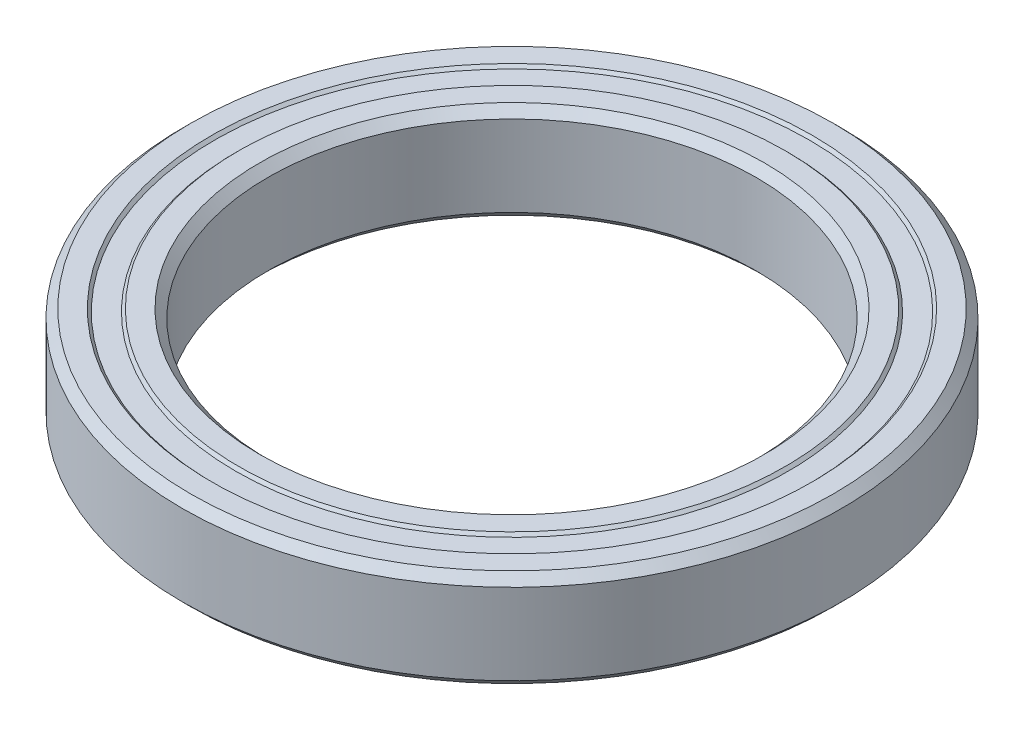
ISO-10303-21;
HEADER;
FILE_DESCRIPTION(('STEP AP214'),'2;1');
FILE_NAME('part.step','',(''),(''),'','','');
FILE_SCHEMA(('AUTOMOTIVE_DESIGN { 1 0 10303 214 1 1 1 1 }'));
ENDSEC;
DATA;
#1=APPLICATION_CONTEXT('core data for automotive mechanical design processes');
#2=APPLICATION_PROTOCOL_DEFINITION('international standard','automotive_design',2000,#1);
#3=PRODUCT_CONTEXT('',#1,'mechanical');
#4=PRODUCT('Part','Part','',(#3));
#5=PRODUCT_RELATED_PRODUCT_CATEGORY('part','',(#4));
#6=PRODUCT_DEFINITION_FORMATION('','',#4);
#7=PRODUCT_DEFINITION_CONTEXT('part definition',#1,'design');
#8=PRODUCT_DEFINITION('design','',#6,#7);
#9=PRODUCT_DEFINITION_SHAPE('','',#8);
#10=(LENGTH_UNIT() NAMED_UNIT(*) SI_UNIT(.MILLI.,.METRE.));
#11=(NAMED_UNIT(*) PLANE_ANGLE_UNIT() SI_UNIT($,.RADIAN.));
#12=(NAMED_UNIT(*) SI_UNIT($,.STERADIAN.) SOLID_ANGLE_UNIT());
#13=UNCERTAINTY_MEASURE_WITH_UNIT(LENGTH_MEASURE(1.E-05),#10,'distance_accuracy_value','');
#14=(GEOMETRIC_REPRESENTATION_CONTEXT(3) GLOBAL_UNCERTAINTY_ASSIGNED_CONTEXT((#13)) GLOBAL_UNIT_ASSIGNED_CONTEXT((#10,
#11,#12)) REPRESENTATION_CONTEXT('',''));
#15=CARTESIAN_POINT('',(0.,0.,0.));
#16=DIRECTION('',(0.,0.,1.));
#17=DIRECTION('',(1.,0.,0.));
#18=AXIS2_PLACEMENT_3D('',#15,#16,#17);
#19=CARTESIAN_POINT('',(0.,2.,0.));
#20=DIRECTION('',(0.,1.,0.));
#21=DIRECTION('',(0.,0.,1.));
#22=AXIS2_PLACEMENT_3D('',#19,#20,#21);
#23=CONICAL_SURFACE('',#22,10.34284,0.78539816339745);
#24=CARTESIAN_POINT('',(0.,1.65716,0.));
#25=DIRECTION('',(0.,-1.,0.));
#26=DIRECTION('',(0.,0.,-1.));
#27=AXIS2_PLACEMENT_3D('',#24,#25,#26);
#28=CIRCLE('',#27,10.);
#29=CARTESIAN_POINT('',(0.,1.65716,-10.));
#30=VERTEX_POINT('',#29);
#31=EDGE_CURVE('E10',#30,#30,#28,.T.);
#32=ORIENTED_EDGE('',*,*,#31,.T.);
#33=EDGE_LOOP('',(#32));
#34=FACE_BOUND('',#33,.T.);
#35=CARTESIAN_POINT('',(0.,2.,0.));
#36=DIRECTION('',(0.,-1.,0.));
#37=DIRECTION('',(0.,0.,-1.));
#38=AXIS2_PLACEMENT_3D('',#35,#36,#37);
#39=CIRCLE('',#38,10.34284);
#40=CARTESIAN_POINT('',(0.,2.,-10.34284));
#41=VERTEX_POINT('',#40);
#42=EDGE_CURVE('E89',#41,#41,#39,.T.);
#43=ORIENTED_EDGE('',*,*,#42,.F.);
#44=EDGE_LOOP('',(#43));
#45=FACE_BOUND('',#44,.T.);
#46=ADVANCED_FACE('F37',(#34,#45),#23,.F.);
#47=CARTESIAN_POINT('',(0.,-1.34942197217015,0.));
#48=DIRECTION('',(0.,-1.,0.));
#49=DIRECTION('',(0.,0.,-1.));
#50=AXIS2_PLACEMENT_3D('',#47,#48,#49);
#51=CYLINDRICAL_SURFACE('',#50,10.);
#52=CARTESIAN_POINT('',(0.,-1.65716,0.));
#53=DIRECTION('',(0.,-1.,0.));
#54=DIRECTION('',(0.,0.,-1.));
#55=AXIS2_PLACEMENT_3D('',#52,#53,#54);
#56=CIRCLE('',#55,10.);
#57=CARTESIAN_POINT('',(0.,-1.65716,-10.));
#58=VERTEX_POINT('',#57);
#59=EDGE_CURVE('E43',#58,#58,#56,.T.);
#60=ORIENTED_EDGE('',*,*,#59,.T.);
#61=EDGE_LOOP('',(#60));
#62=FACE_BOUND('',#61,.T.);
#63=ORIENTED_EDGE('',*,*,#31,.F.);
#64=EDGE_LOOP('',(#63));
#65=FACE_BOUND('',#64,.T.);
#66=ADVANCED_FACE('F97',(#62,#65),#51,.F.);
#67=CARTESIAN_POINT('',(0.,-1.65716,0.));
#68=DIRECTION('',(0.,-1.,0.));
#69=DIRECTION('',(0.,0.,-1.));
#70=AXIS2_PLACEMENT_3D('',#67,#68,#69);
#71=CONICAL_SURFACE('',#70,10.,0.785398163397446);
#72=CARTESIAN_POINT('',(0.,-2.,0.));
#73=DIRECTION('',(0.,-1.,0.));
#74=DIRECTION('',(0.,0.,-1.));
#75=AXIS2_PLACEMENT_3D('',#72,#73,#74);
#76=CIRCLE('',#75,10.34284);
#77=CARTESIAN_POINT('',(0.,-2.,-10.34284));
#78=VERTEX_POINT('',#77);
#79=EDGE_CURVE('E47',#78,#78,#76,.T.);
#80=ORIENTED_EDGE('',*,*,#79,.T.);
#81=EDGE_LOOP('',(#80));
#82=FACE_BOUND('',#81,.T.);
#83=ORIENTED_EDGE('',*,*,#59,.F.);
#84=EDGE_LOOP('',(#83));
#85=FACE_BOUND('',#84,.T.);
#86=ADVANCED_FACE('F101',(#82,#85),#71,.F.);
#87=CARTESIAN_POINT('',(10.34284,-2.,0.));
#88=DIRECTION('',(0.,-1.,0.));
#89=DIRECTION('',(0.,0.,-1.));
#90=AXIS2_PLACEMENT_3D('',#87,#88,#89);
#91=PLANE('',#90);
#92=CARTESIAN_POINT('',(0.,-2.,0.));
#93=DIRECTION('',(0.,-1.,0.));
#94=DIRECTION('',(0.,0.,-1.));
#95=AXIS2_PLACEMENT_3D('',#92,#93,#94);
#96=CIRCLE('',#95,11.19994);
#97=CARTESIAN_POINT('',(0.,-2.,-11.19994));
#98=VERTEX_POINT('',#97);
#99=EDGE_CURVE('E51',#98,#98,#96,.T.);
#100=ORIENTED_EDGE('',*,*,#99,.T.);
#101=EDGE_LOOP('',(#100));
#102=FACE_BOUND('',#101,.T.);
#103=ORIENTED_EDGE('',*,*,#79,.F.);
#104=EDGE_LOOP('',(#103));
#105=FACE_BOUND('',#104,.T.);
#106=ADVANCED_FACE('F105',(#102,#105),#91,.T.);
#107=CARTESIAN_POINT('',(0.,-2.,0.));
#108=DIRECTION('',(0.,1.,0.));
#109=DIRECTION('',(0.,0.,1.));
#110=AXIS2_PLACEMENT_3D('',#107,#108,#109);
#111=CONICAL_SURFACE('',#110,11.19994,0.785398163397439);
#112=CARTESIAN_POINT('',(0.,-1.88572,0.));
#113=DIRECTION('',(0.,-1.,0.));
#114=DIRECTION('',(0.,0.,-1.));
#115=AXIS2_PLACEMENT_3D('',#112,#113,#114);
#116=CIRCLE('',#115,11.31422);
#117=CARTESIAN_POINT('',(0.,-1.88572,-11.31422));
#118=VERTEX_POINT('',#117);
#119=EDGE_CURVE('E56',#118,#118,#116,.T.);
#120=ORIENTED_EDGE('',*,*,#119,.T.);
#121=EDGE_LOOP('',(#120));
#122=FACE_BOUND('',#121,.T.);
#123=ORIENTED_EDGE('',*,*,#99,.F.);
#124=EDGE_LOOP('',(#123));
#125=FACE_BOUND('',#124,.T.);
#126=ADVANCED_FACE('F112',(#122,#125),#111,.T.);
#127=CARTESIAN_POINT('',(11.31422,-1.88572,0.));
#128=DIRECTION('',(0.,-1.,0.));
#129=DIRECTION('',(0.,0.,-1.));
#130=AXIS2_PLACEMENT_3D('',#127,#128,#129);
#131=PLANE('',#130);
#132=CARTESIAN_POINT('',(0.,-1.88572,0.));
#133=DIRECTION('',(0.,-1.,0.));
#134=DIRECTION('',(0.,0.,-1.));
#135=AXIS2_PLACEMENT_3D('',#132,#133,#134);
#136=CIRCLE('',#135,12.18578);
#137=CARTESIAN_POINT('',(0.,-1.88572,-12.18578));
#138=VERTEX_POINT('',#137);
#139=EDGE_CURVE('E59',#138,#138,#136,.T.);
#140=ORIENTED_EDGE('',*,*,#139,.T.);
#141=EDGE_LOOP('',(#140));
#142=FACE_BOUND('',#141,.T.);
#143=ORIENTED_EDGE('',*,*,#119,.F.);
#144=EDGE_LOOP('',(#143));
#145=FACE_BOUND('',#144,.T.);
#146=ADVANCED_FACE('F116',(#142,#145),#131,.T.);
#147=CARTESIAN_POINT('',(0.,-1.88572,0.));
#148=DIRECTION('',(0.,-1.,0.));
#149=DIRECTION('',(0.,0.,-1.));
#150=AXIS2_PLACEMENT_3D('',#147,#148,#149);
#151=CONICAL_SURFACE('',#150,12.18578,0.78539816339744);
#152=CARTESIAN_POINT('',(0.,-2.,0.));
#153=DIRECTION('',(0.,-1.,0.));
#154=DIRECTION('',(0.,0.,-1.));
#155=AXIS2_PLACEMENT_3D('',#152,#153,#154);
#156=CIRCLE('',#155,12.30006);
#157=CARTESIAN_POINT('',(0.,-2.,-12.30006));
#158=VERTEX_POINT('',#157);
#159=EDGE_CURVE('E62',#158,#158,#156,.T.);
#160=ORIENTED_EDGE('',*,*,#159,.T.);
#161=EDGE_LOOP('',(#160));
#162=FACE_BOUND('',#161,.T.);
#163=ORIENTED_EDGE('',*,*,#139,.F.);
#164=EDGE_LOOP('',(#163));
#165=FACE_BOUND('',#164,.T.);
#166=ADVANCED_FACE('F120',(#162,#165),#151,.F.);
#167=CARTESIAN_POINT('',(12.30006,-2.,0.));
#168=DIRECTION('',(0.,-1.,0.));
#169=DIRECTION('',(0.,0.,-1.));
#170=AXIS2_PLACEMENT_3D('',#167,#168,#169);
#171=PLANE('',#170);
#172=CARTESIAN_POINT('',(0.,-2.,0.));
#173=DIRECTION('',(0.,-1.,0.));
#174=DIRECTION('',(0.,0.,-1.));
#175=AXIS2_PLACEMENT_3D('',#172,#173,#174);
#176=CIRCLE('',#175,13.15716);
#177=CARTESIAN_POINT('',(0.,-2.,-13.15716));
#178=VERTEX_POINT('',#177);
#179=EDGE_CURVE('E65',#178,#178,#176,.T.);
#180=ORIENTED_EDGE('',*,*,#179,.T.);
#181=EDGE_LOOP('',(#180));
#182=FACE_BOUND('',#181,.T.);
#183=ORIENTED_EDGE('',*,*,#159,.F.);
#184=EDGE_LOOP('',(#183));
#185=FACE_BOUND('',#184,.T.);
#186=ADVANCED_FACE('F124',(#182,#185),#171,.T.);
#187=CARTESIAN_POINT('',(0.,-2.,0.));
#188=DIRECTION('',(0.,1.,0.));
#189=DIRECTION('',(0.,0.,1.));
#190=AXIS2_PLACEMENT_3D('',#187,#188,#189);
#191=CONICAL_SURFACE('',#190,13.15716,0.785398163397445);
#192=CARTESIAN_POINT('',(0.,-1.65716,0.));
#193=DIRECTION('',(0.,-1.,0.));
#194=DIRECTION('',(0.,0.,-1.));
#195=AXIS2_PLACEMENT_3D('',#192,#193,#194);
#196=CIRCLE('',#195,13.5);
#197=CARTESIAN_POINT('',(0.,-1.65716,-13.5));
#198=VERTEX_POINT('',#197);
#199=EDGE_CURVE('E68',#198,#198,#196,.T.);
#200=ORIENTED_EDGE('',*,*,#199,.T.);
#201=EDGE_LOOP('',(#200));
#202=FACE_BOUND('',#201,.T.);
#203=ORIENTED_EDGE('',*,*,#179,.F.);
#204=EDGE_LOOP('',(#203));
#205=FACE_BOUND('',#204,.T.);
#206=ADVANCED_FACE('F128',(#202,#205),#191,.T.);
#207=CARTESIAN_POINT('',(0.,-1.34942197217015,0.));
#208=DIRECTION('',(0.,-1.,0.));
#209=DIRECTION('',(0.,0.,-1.));
#210=AXIS2_PLACEMENT_3D('',#207,#208,#209);
#211=CYLINDRICAL_SURFACE('',#210,13.5);
#212=CARTESIAN_POINT('',(0.,1.65716,0.));
#213=DIRECTION('',(0.,-1.,0.));
#214=DIRECTION('',(0.,0.,-1.));
#215=AXIS2_PLACEMENT_3D('',#212,#213,#214);
#216=CIRCLE('',#215,13.5);
#217=CARTESIAN_POINT('',(0.,1.65716,-13.5));
#218=VERTEX_POINT('',#217);
#219=EDGE_CURVE('E71',#218,#218,#216,.T.);
#220=ORIENTED_EDGE('',*,*,#219,.T.);
#221=EDGE_LOOP('',(#220));
#222=FACE_BOUND('',#221,.T.);
#223=ORIENTED_EDGE('',*,*,#199,.F.);
#224=EDGE_LOOP('',(#223));
#225=FACE_BOUND('',#224,.T.);
#226=ADVANCED_FACE('F132',(#222,#225),#211,.T.);
#227=CARTESIAN_POINT('',(0.,1.65716,0.));
#228=DIRECTION('',(0.,-1.,0.));
#229=DIRECTION('',(0.,0.,-1.));
#230=AXIS2_PLACEMENT_3D('',#227,#228,#229);
#231=CONICAL_SURFACE('',#230,13.5,0.785398163397446);
#232=CARTESIAN_POINT('',(0.,2.,0.));
#233=DIRECTION('',(0.,-1.,0.));
#234=DIRECTION('',(0.,0.,-1.));
#235=AXIS2_PLACEMENT_3D('',#232,#233,#234);
#236=CIRCLE('',#235,13.15716);
#237=CARTESIAN_POINT('',(0.,2.,-13.15716));
#238=VERTEX_POINT('',#237);
#239=EDGE_CURVE('E74',#238,#238,#236,.T.);
#240=ORIENTED_EDGE('',*,*,#239,.T.);
#241=EDGE_LOOP('',(#240));
#242=FACE_BOUND('',#241,.T.);
#243=ORIENTED_EDGE('',*,*,#219,.F.);
#244=EDGE_LOOP('',(#243));
#245=FACE_BOUND('',#244,.T.);
#246=ADVANCED_FACE('F136',(#242,#245),#231,.T.);
#247=CARTESIAN_POINT('',(13.15716,2.,0.));
#248=DIRECTION('',(0.,1.,0.));
#249=DIRECTION('',(0.,0.,1.));
#250=AXIS2_PLACEMENT_3D('',#247,#248,#249);
#251=PLANE('',#250);
#252=CARTESIAN_POINT('',(0.,2.,0.));
#253=DIRECTION('',(0.,-1.,0.));
#254=DIRECTION('',(0.,0.,-1.));
#255=AXIS2_PLACEMENT_3D('',#252,#253,#254);
#256=CIRCLE('',#255,12.30006);
#257=CARTESIAN_POINT('',(0.,2.,-12.30006));
#258=VERTEX_POINT('',#257);
#259=EDGE_CURVE('E77',#258,#258,#256,.T.);
#260=ORIENTED_EDGE('',*,*,#259,.T.);
#261=EDGE_LOOP('',(#260));
#262=FACE_BOUND('',#261,.T.);
#263=ORIENTED_EDGE('',*,*,#239,.F.);
#264=EDGE_LOOP('',(#263));
#265=FACE_BOUND('',#264,.T.);
#266=ADVANCED_FACE('F140',(#262,#265),#251,.T.);
#267=CARTESIAN_POINT('',(0.,2.,0.));
#268=DIRECTION('',(0.,1.,0.));
#269=DIRECTION('',(0.,0.,1.));
#270=AXIS2_PLACEMENT_3D('',#267,#268,#269);
#271=CONICAL_SURFACE('',#270,12.30006,0.785398163397446);
#272=CARTESIAN_POINT('',(0.,1.88572,0.));
#273=DIRECTION('',(0.,-1.,0.));
#274=DIRECTION('',(0.,0.,-1.));
#275=AXIS2_PLACEMENT_3D('',#272,#273,#274);
#276=CIRCLE('',#275,12.18578);
#277=CARTESIAN_POINT('',(0.,1.88572,-12.18578));
#278=VERTEX_POINT('',#277);
#279=EDGE_CURVE('E80',#278,#278,#276,.T.);
#280=ORIENTED_EDGE('',*,*,#279,.T.);
#281=EDGE_LOOP('',(#280));
#282=FACE_BOUND('',#281,.T.);
#283=ORIENTED_EDGE('',*,*,#259,.F.);
#284=EDGE_LOOP('',(#283));
#285=FACE_BOUND('',#284,.T.);
#286=ADVANCED_FACE('F144',(#282,#285),#271,.F.);
#287=CARTESIAN_POINT('',(12.18578,1.88572,0.));
#288=DIRECTION('',(0.,1.,0.));
#289=DIRECTION('',(0.,0.,1.));
#290=AXIS2_PLACEMENT_3D('',#287,#288,#289);
#291=PLANE('',#290);
#292=CARTESIAN_POINT('',(0.,1.88572,0.));
#293=DIRECTION('',(0.,-1.,0.));
#294=DIRECTION('',(0.,0.,-1.));
#295=AXIS2_PLACEMENT_3D('',#292,#293,#294);
#296=CIRCLE('',#295,11.31422);
#297=CARTESIAN_POINT('',(0.,1.88572,-11.31422));
#298=VERTEX_POINT('',#297);
#299=EDGE_CURVE('E83',#298,#298,#296,.T.);
#300=ORIENTED_EDGE('',*,*,#299,.T.);
#301=EDGE_LOOP('',(#300));
#302=FACE_BOUND('',#301,.T.);
#303=ORIENTED_EDGE('',*,*,#279,.F.);
#304=EDGE_LOOP('',(#303));
#305=FACE_BOUND('',#304,.T.);
#306=ADVANCED_FACE('F148',(#302,#305),#291,.T.);
#307=CARTESIAN_POINT('',(0.,1.88572,0.));
#308=DIRECTION('',(0.,-1.,0.));
#309=DIRECTION('',(0.,0.,-1.));
#310=AXIS2_PLACEMENT_3D('',#307,#308,#309);
#311=CONICAL_SURFACE('',#310,11.31422,0.785398163397443);
#312=CARTESIAN_POINT('',(0.,2.,0.));
#313=DIRECTION('',(0.,-1.,0.));
#314=DIRECTION('',(0.,0.,-1.));
#315=AXIS2_PLACEMENT_3D('',#312,#313,#314);
#316=CIRCLE('',#315,11.19994);
#317=CARTESIAN_POINT('',(0.,2.,-11.19994));
#318=VERTEX_POINT('',#317);
#319=EDGE_CURVE('E86',#318,#318,#316,.T.);
#320=ORIENTED_EDGE('',*,*,#319,.T.);
#321=EDGE_LOOP('',(#320));
#322=FACE_BOUND('',#321,.T.);
#323=ORIENTED_EDGE('',*,*,#299,.F.);
#324=EDGE_LOOP('',(#323));
#325=FACE_BOUND('',#324,.T.);
#326=ADVANCED_FACE('F152',(#322,#325),#311,.T.);
#327=CARTESIAN_POINT('',(11.19994,2.,0.));
#328=DIRECTION('',(0.,1.,0.));
#329=DIRECTION('',(0.,0.,1.));
#330=AXIS2_PLACEMENT_3D('',#327,#328,#329);
#331=PLANE('',#330);
#332=ORIENTED_EDGE('',*,*,#42,.T.);
#333=EDGE_LOOP('',(#332));
#334=FACE_BOUND('',#333,.T.);
#335=ORIENTED_EDGE('',*,*,#319,.F.);
#336=EDGE_LOOP('',(#335));
#337=FACE_BOUND('',#336,.T.);
#338=ADVANCED_FACE('F93',(#334,#337),#331,.T.);
#339=CLOSED_SHELL('',(#46,#66,#86,#106,#126,#146,#166,#186,#206,#226,#246,#266,#286,#306,#326,#338));
#340=MANIFOLD_SOLID_BREP('B2',#339);
#341=ADVANCED_BREP_SHAPE_REPRESENTATION('',(#18,#340),#14);
#342=SHAPE_DEFINITION_REPRESENTATION(#9,#341);
ENDSEC;
END-ISO-10303-21;
